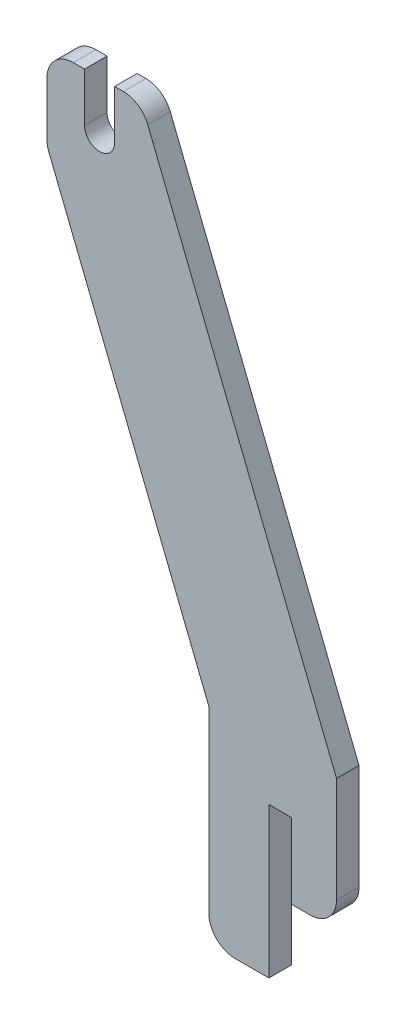
ISO-10303-21;
HEADER;
FILE_DESCRIPTION(('STEP AP214'),'2;1');
FILE_NAME('part.step','',(''),(''),'','','');
FILE_SCHEMA(('AUTOMOTIVE_DESIGN { 1 0 10303 214 1 1 1 1 }'));
ENDSEC;
DATA;
#1=APPLICATION_CONTEXT('core data for automotive mechanical design processes');
#2=APPLICATION_PROTOCOL_DEFINITION('international standard','automotive_design',2000,#1);
#3=PRODUCT_CONTEXT('',#1,'mechanical');
#4=PRODUCT('Part','Part','',(#3));
#5=PRODUCT_RELATED_PRODUCT_CATEGORY('part','',(#4));
#6=PRODUCT_DEFINITION_FORMATION('','',#4);
#7=PRODUCT_DEFINITION_CONTEXT('part definition',#1,'design');
#8=PRODUCT_DEFINITION('design','',#6,#7);
#9=PRODUCT_DEFINITION_SHAPE('','',#8);
#10=(LENGTH_UNIT() NAMED_UNIT(*) SI_UNIT(.MILLI.,.METRE.));
#11=(NAMED_UNIT(*) PLANE_ANGLE_UNIT() SI_UNIT($,.RADIAN.));
#12=(NAMED_UNIT(*) SI_UNIT($,.STERADIAN.) SOLID_ANGLE_UNIT());
#13=UNCERTAINTY_MEASURE_WITH_UNIT(LENGTH_MEASURE(1.E-05),#10,'distance_accuracy_value','');
#14=(GEOMETRIC_REPRESENTATION_CONTEXT(3) GLOBAL_UNCERTAINTY_ASSIGNED_CONTEXT((#13)) GLOBAL_UNIT_ASSIGNED_CONTEXT((#10,
#11,#12)) REPRESENTATION_CONTEXT('',''));
#15=CARTESIAN_POINT('',(0.,0.,0.));
#16=DIRECTION('',(0.,0.,1.));
#17=DIRECTION('',(1.,0.,0.));
#18=AXIS2_PLACEMENT_3D('',#15,#16,#17);
#19=CARTESIAN_POINT('',(153.518730442285,253.090872108874,6.));
#20=DIRECTION('',(0.,0.,-1.));
#21=DIRECTION('',(-1.,0.,0.));
#22=AXIS2_PLACEMENT_3D('',#19,#20,#21);
#23=CYLINDRICAL_SURFACE('',#22,4.);
#24=CARTESIAN_POINT('',(153.518730442285,253.090872108874,0.));
#25=DIRECTION('',(0.,0.,-1.));
#26=DIRECTION('',(1.,0.,0.));
#27=AXIS2_PLACEMENT_3D('',#24,#25,#26);
#28=CIRCLE('',#27,4.);
#29=CARTESIAN_POINT('',(157.518730442285,253.090872108874,0.));
#30=VERTEX_POINT('',#29);
#31=CARTESIAN_POINT('',(149.518730442285,253.090872108874,0.));
#32=VERTEX_POINT('',#31);
#33=EDGE_CURVE('E206',#30,#32,#28,.T.);
#34=ORIENTED_EDGE('',*,*,#33,.T.);
#35=DIRECTION('',(0.,0.,-1.));
#36=VECTOR('',#35,1.);
#37=CARTESIAN_POINT('',(149.518730442285,253.090872108874,6.));
#38=LINE('',#37,#36);
#39=CARTESIAN_POINT('',(149.518730442285,253.090872108874,6.));
#40=VERTEX_POINT('',#39);
#41=EDGE_CURVE('E11',#40,#32,#38,.T.);
#42=ORIENTED_EDGE('',*,*,#41,.F.);
#43=CARTESIAN_POINT('',(153.518730442285,253.090872108874,6.));
#44=DIRECTION('',(0.,0.,-1.));
#45=DIRECTION('',(1.,0.,0.));
#46=AXIS2_PLACEMENT_3D('',#43,#44,#45);
#47=CIRCLE('',#46,4.);
#48=CARTESIAN_POINT('',(157.518730442285,253.090872108874,6.));
#49=VERTEX_POINT('',#48);
#50=EDGE_CURVE('E244',#49,#40,#47,.T.);
#51=ORIENTED_EDGE('',*,*,#50,.F.);
#52=DIRECTION('',(0.,0.,-1.));
#53=VECTOR('',#52,1.);
#54=CARTESIAN_POINT('',(157.518730442285,253.090872108874,6.));
#55=LINE('',#54,#53);
#56=EDGE_CURVE('E202',#49,#30,#55,.T.);
#57=ORIENTED_EDGE('',*,*,#56,.T.);
#58=EDGE_LOOP('',(#34,#42,#51,#57));
#59=FACE_BOUND('',#58,.T.);
#60=ADVANCED_FACE('F38',(#59),#23,.F.);
#61=CARTESIAN_POINT('',(149.518730442285,266.090872108874,6.));
#62=DIRECTION('',(-1.,0.,0.));
#63=DIRECTION('',(0.,-1.,0.));
#64=AXIS2_PLACEMENT_3D('',#61,#62,#63);
#65=PLANE('',#64);
#66=DIRECTION('',(0.,1.,0.));
#67=VECTOR('',#66,1.);
#68=CARTESIAN_POINT('',(149.518730442285,266.090872108874,0.));
#69=LINE('',#68,#67);
#70=CARTESIAN_POINT('',(149.518730442285,266.090872108874,0.));
#71=VERTEX_POINT('',#70);
#72=EDGE_CURVE('E209',#32,#71,#69,.T.);
#73=ORIENTED_EDGE('',*,*,#72,.T.);
#74=DIRECTION('',(0.,0.,-1.));
#75=VECTOR('',#74,1.);
#76=CARTESIAN_POINT('',(149.518730442285,266.090872108874,6.));
#77=LINE('',#76,#75);
#78=CARTESIAN_POINT('',(149.518730442285,266.090872108874,6.));
#79=VERTEX_POINT('',#78);
#80=EDGE_CURVE('E46',#79,#71,#77,.T.);
#81=ORIENTED_EDGE('',*,*,#80,.F.);
#82=DIRECTION('',(0.,1.,0.));
#83=VECTOR('',#82,1.);
#84=CARTESIAN_POINT('',(149.518730442285,266.090872108874,6.));
#85=LINE('',#84,#83);
#86=EDGE_CURVE('E133',#40,#79,#85,.T.);
#87=ORIENTED_EDGE('',*,*,#86,.F.);
#88=ORIENTED_EDGE('',*,*,#41,.T.);
#89=EDGE_LOOP('',(#73,#81,#87,#88));
#90=FACE_BOUND('',#89,.T.);
#91=ADVANCED_FACE('F362',(#90),#65,.F.);
#92=CARTESIAN_POINT('',(149.518730442285,266.090872108874,6.));
#93=DIRECTION('',(0.,-1.,0.));
#94=DIRECTION('',(0.,0.,-1.));
#95=AXIS2_PLACEMENT_3D('',#92,#93,#94);
#96=PLANE('',#95);
#97=DIRECTION('',(-1.,0.,0.));
#98=VECTOR('',#97,1.);
#99=CARTESIAN_POINT('',(149.518730442285,266.090872108874,0.));
#100=LINE('',#99,#98);
#101=CARTESIAN_POINT('',(146.518730442285,266.090872108874,0.));
#102=VERTEX_POINT('',#101);
#103=EDGE_CURVE('E211',#71,#102,#100,.T.);
#104=ORIENTED_EDGE('',*,*,#103,.T.);
#105=DIRECTION('',(0.,0.,-1.));
#106=VECTOR('',#105,1.);
#107=CARTESIAN_POINT('',(146.518730442285,266.090872108874,6.));
#108=LINE('',#107,#106);
#109=CARTESIAN_POINT('',(146.518730442285,266.090872108874,6.));
#110=VERTEX_POINT('',#109);
#111=EDGE_CURVE('E287',#110,#102,#108,.T.);
#112=ORIENTED_EDGE('',*,*,#111,.F.);
#113=DIRECTION('',(-1.,0.,0.));
#114=VECTOR('',#113,1.);
#115=CARTESIAN_POINT('',(149.518730442285,266.090872108874,6.));
#116=LINE('',#115,#114);
#117=EDGE_CURVE('E295',#79,#110,#116,.T.);
#118=ORIENTED_EDGE('',*,*,#117,.F.);
#119=ORIENTED_EDGE('',*,*,#80,.T.);
#120=EDGE_LOOP('',(#104,#112,#118,#119));
#121=FACE_BOUND('',#120,.T.);
#122=ADVANCED_FACE('F293',(#121),#96,.F.);
#123=CARTESIAN_POINT('',(146.518730442285,259.090872108874,6.));
#124=DIRECTION('',(0.,0.,-1.));
#125=DIRECTION('',(-1.,0.,0.));
#126=AXIS2_PLACEMENT_3D('',#123,#124,#125);
#127=CYLINDRICAL_SURFACE('',#126,6.99999999999998);
#128=CARTESIAN_POINT('',(146.518730442285,259.090872108874,0.));
#129=DIRECTION('',(0.,0.,1.));
#130=DIRECTION('',(1.,0.,0.));
#131=AXIS2_PLACEMENT_3D('',#128,#129,#130);
#132=CIRCLE('',#131,6.99999999999998);
#133=CARTESIAN_POINT('',(139.518730442285,259.090872108874,0.));
#134=VERTEX_POINT('',#133);
#135=EDGE_CURVE('E213',#102,#134,#132,.T.);
#136=ORIENTED_EDGE('',*,*,#135,.T.);
#137=DIRECTION('',(0.,0.,-1.));
#138=VECTOR('',#137,1.);
#139=CARTESIAN_POINT('',(139.518730442285,259.090872108874,6.));
#140=LINE('',#139,#138);
#141=CARTESIAN_POINT('',(139.518730442285,259.090872108874,6.));
#142=VERTEX_POINT('',#141);
#143=EDGE_CURVE('E284',#142,#134,#140,.T.);
#144=ORIENTED_EDGE('',*,*,#143,.F.);
#145=CARTESIAN_POINT('',(146.518730442285,259.090872108874,6.));
#146=DIRECTION('',(0.,0.,1.));
#147=DIRECTION('',(1.,0.,0.));
#148=AXIS2_PLACEMENT_3D('',#145,#146,#147);
#149=CIRCLE('',#148,6.99999999999998);
#150=EDGE_CURVE('E313',#110,#142,#149,.T.);
#151=ORIENTED_EDGE('',*,*,#150,.F.);
#152=ORIENTED_EDGE('',*,*,#111,.T.);
#153=EDGE_LOOP('',(#136,#144,#151,#152));
#154=FACE_BOUND('',#153,.T.);
#155=ADVANCED_FACE('F304',(#154),#127,.T.);
#156=CARTESIAN_POINT('',(139.518730442285,259.090872108874,6.));
#157=DIRECTION('',(1.,0.,0.));
#158=DIRECTION('',(0.,0.,-1.));
#159=AXIS2_PLACEMENT_3D('',#156,#157,#158);
#160=PLANE('',#159);
#161=DIRECTION('',(0.,-1.,0.));
#162=VECTOR('',#161,1.);
#163=CARTESIAN_POINT('',(139.518730442285,259.090872108874,0.));
#164=LINE('',#163,#162);
#165=CARTESIAN_POINT('',(139.518730442285,244.812476298915,0.));
#166=VERTEX_POINT('',#165);
#167=EDGE_CURVE('E215',#134,#166,#164,.T.);
#168=ORIENTED_EDGE('',*,*,#167,.T.);
#169=DIRECTION('',(0.,0.,-1.));
#170=VECTOR('',#169,1.);
#171=CARTESIAN_POINT('',(139.518730442285,244.812476298915,6.));
#172=LINE('',#171,#170);
#173=CARTESIAN_POINT('',(139.518730442285,244.812476298915,6.));
#174=VERTEX_POINT('',#173);
#175=EDGE_CURVE('E281',#174,#166,#172,.T.);
#176=ORIENTED_EDGE('',*,*,#175,.F.);
#177=DIRECTION('',(0.,-1.,0.));
#178=VECTOR('',#177,1.);
#179=CARTESIAN_POINT('',(139.518730442285,259.090872108874,6.));
#180=LINE('',#179,#178);
#181=EDGE_CURVE('E310',#142,#174,#180,.T.);
#182=ORIENTED_EDGE('',*,*,#181,.F.);
#183=ORIENTED_EDGE('',*,*,#143,.T.);
#184=EDGE_LOOP('',(#168,#176,#182,#183));
#185=FACE_BOUND('',#184,.T.);
#186=ADVANCED_FACE('F308',(#185),#160,.F.);
#187=CARTESIAN_POINT('',(146.518730442285,244.812476298915,6.));
#188=DIRECTION('',(0.,0.,-1.));
#189=DIRECTION('',(-1.,0.,0.));
#190=AXIS2_PLACEMENT_3D('',#187,#188,#189);
#191=CYLINDRICAL_SURFACE('',#190,7.00000000000001);
#192=CARTESIAN_POINT('',(146.518730442285,244.812476298915,0.));
#193=DIRECTION('',(0.,0.,1.));
#194=DIRECTION('',(1.,0.,0.));
#195=AXIS2_PLACEMENT_3D('',#192,#193,#194);
#196=CIRCLE('',#195,7.00000000000001);
#197=CARTESIAN_POINT('',(140.019393606088,242.212741564437,0.));
#198=VERTEX_POINT('',#197);
#199=EDGE_CURVE('E217',#166,#198,#196,.T.);
#200=ORIENTED_EDGE('',*,*,#199,.T.);
#201=DIRECTION('',(0.,0.,-1.));
#202=VECTOR('',#201,1.);
#203=CARTESIAN_POINT('',(140.019393606088,242.212741564437,6.));
#204=LINE('',#203,#202);
#205=CARTESIAN_POINT('',(140.019393606088,242.212741564437,6.));
#206=VERTEX_POINT('',#205);
#207=EDGE_CURVE('E278',#206,#198,#204,.T.);
#208=ORIENTED_EDGE('',*,*,#207,.F.);
#209=CARTESIAN_POINT('',(146.518730442285,244.812476298915,6.));
#210=DIRECTION('',(0.,0.,1.));
#211=DIRECTION('',(1.,0.,0.));
#212=AXIS2_PLACEMENT_3D('',#209,#210,#211);
#213=CIRCLE('',#212,7.00000000000001);
#214=EDGE_CURVE('E312',#174,#206,#213,.T.);
#215=ORIENTED_EDGE('',*,*,#214,.F.);
#216=ORIENTED_EDGE('',*,*,#175,.T.);
#217=EDGE_LOOP('',(#200,#208,#215,#216));
#218=FACE_BOUND('',#217,.T.);
#219=ADVANCED_FACE('F375',(#218),#191,.T.);
#220=CARTESIAN_POINT('',(140.019393606088,242.212741564437,6.));
#221=DIRECTION('',(0.928476690885259,0.371390676354103,0.));
#222=DIRECTION('',(-0.371390676354103,0.92847669088526,0.));
#223=AXIS2_PLACEMENT_3D('',#220,#221,#222);
#224=PLANE('',#223);
#225=DIRECTION('',(0.371390676354103,-0.92847669088526,0.));
#226=VECTOR('',#225,1.);
#227=CARTESIAN_POINT('',(140.019393606088,242.212741564437,0.));
#228=LINE('',#227,#226);
#229=CARTESIAN_POINT('',(182.587601096187,135.792222839189,0.));
#230=VERTEX_POINT('',#229);
#231=EDGE_CURVE('E219',#198,#230,#228,.T.);
#232=ORIENTED_EDGE('',*,*,#231,.T.);
#233=DIRECTION('',(0.,0.,-1.));
#234=VECTOR('',#233,1.);
#235=CARTESIAN_POINT('',(182.587601096187,135.792222839189,6.));
#236=LINE('',#235,#234);
#237=CARTESIAN_POINT('',(182.587601096187,135.792222839189,6.));
#238=VERTEX_POINT('',#237);
#239=EDGE_CURVE('E275',#238,#230,#236,.T.);
#240=ORIENTED_EDGE('',*,*,#239,.F.);
#241=DIRECTION('',(0.371390676354103,-0.92847669088526,0.));
#242=VECTOR('',#241,1.);
#243=CARTESIAN_POINT('',(140.019393606088,242.212741564437,6.));
#244=LINE('',#243,#242);
#245=EDGE_CURVE('E315',#206,#238,#244,.T.);
#246=ORIENTED_EDGE('',*,*,#245,.F.);
#247=ORIENTED_EDGE('',*,*,#207,.T.);
#248=EDGE_LOOP('',(#232,#240,#246,#247));
#249=FACE_BOUND('',#248,.T.);
#250=ADVANCED_FACE('F378',(#249),#224,.F.);
#251=CARTESIAN_POINT('',(182.587601096187,88.0908721088744,6.));
#252=DIRECTION('',(1.,0.,0.));
#253=DIRECTION('',(0.,0.,-1.));
#254=AXIS2_PLACEMENT_3D('',#251,#252,#253);
#255=PLANE('',#254);
#256=DIRECTION('',(0.,-1.,0.));
#257=VECTOR('',#256,1.);
#258=CARTESIAN_POINT('',(182.587601096187,88.0908721088744,0.));
#259=LINE('',#258,#257);
#260=CARTESIAN_POINT('',(182.587601096187,88.0908721088744,0.));
#261=VERTEX_POINT('',#260);
#262=EDGE_CURVE('E221',#230,#261,#259,.T.);
#263=ORIENTED_EDGE('',*,*,#262,.T.);
#264=DIRECTION('',(0.,0.,-1.));
#265=VECTOR('',#264,1.);
#266=CARTESIAN_POINT('',(182.587601096187,88.0908721088744,6.));
#267=LINE('',#266,#265);
#268=CARTESIAN_POINT('',(182.587601096187,88.0908721088744,6.));
#269=VERTEX_POINT('',#268);
#270=EDGE_CURVE('E272',#269,#261,#267,.T.);
#271=ORIENTED_EDGE('',*,*,#270,.F.);
#272=DIRECTION('',(0.,-1.,0.));
#273=VECTOR('',#272,1.);
#274=CARTESIAN_POINT('',(182.587601096187,88.0908721088744,6.));
#275=LINE('',#274,#273);
#276=EDGE_CURVE('E321',#238,#269,#275,.T.);
#277=ORIENTED_EDGE('',*,*,#276,.F.);
#278=ORIENTED_EDGE('',*,*,#239,.T.);
#279=EDGE_LOOP('',(#263,#271,#277,#278));
#280=FACE_BOUND('',#279,.T.);
#281=ADVANCED_FACE('F382',(#280),#255,.F.);
#282=CARTESIAN_POINT('',(189.587601096187,88.0908721088744,6.));
#283=DIRECTION('',(0.,0.,-1.));
#284=DIRECTION('',(-1.,0.,0.));
#285=AXIS2_PLACEMENT_3D('',#282,#283,#284);
#286=CYLINDRICAL_SURFACE('',#285,7.);
#287=CARTESIAN_POINT('',(189.587601096187,88.0908721088744,0.));
#288=DIRECTION('',(0.,0.,1.));
#289=DIRECTION('',(1.,0.,0.));
#290=AXIS2_PLACEMENT_3D('',#287,#288,#289);
#291=CIRCLE('',#290,7.);
#292=CARTESIAN_POINT('',(189.587601096187,81.0908721088744,0.));
#293=VERTEX_POINT('',#292);
#294=EDGE_CURVE('E223',#261,#293,#291,.T.);
#295=ORIENTED_EDGE('',*,*,#294,.T.);
#296=DIRECTION('',(0.,0.,-1.));
#297=VECTOR('',#296,1.);
#298=CARTESIAN_POINT('',(189.587601096187,81.0908721088744,6.));
#299=LINE('',#298,#297);
#300=CARTESIAN_POINT('',(189.587601096187,81.0908721088744,6.));
#301=VERTEX_POINT('',#300);
#302=EDGE_CURVE('E269',#301,#293,#299,.T.);
#303=ORIENTED_EDGE('',*,*,#302,.F.);
#304=CARTESIAN_POINT('',(189.587601096187,88.0908721088744,6.));
#305=DIRECTION('',(0.,0.,1.));
#306=DIRECTION('',(1.,0.,0.));
#307=AXIS2_PLACEMENT_3D('',#304,#305,#306);
#308=CIRCLE('',#307,7.);
#309=EDGE_CURVE('E323',#269,#301,#308,.T.);
#310=ORIENTED_EDGE('',*,*,#309,.F.);
#311=ORIENTED_EDGE('',*,*,#270,.T.);
#312=EDGE_LOOP('',(#295,#303,#310,#311));
#313=FACE_BOUND('',#312,.T.);
#314=ADVANCED_FACE('F386',(#313),#286,.T.);
#315=CARTESIAN_POINT('',(189.587601096187,81.0908721088744,6.));
#316=DIRECTION('',(0.,1.,0.));
#317=DIRECTION('',(0.,0.,1.));
#318=AXIS2_PLACEMENT_3D('',#315,#316,#317);
#319=PLANE('',#318);
#320=DIRECTION('',(1.,0.,0.));
#321=VECTOR('',#320,1.);
#322=CARTESIAN_POINT('',(189.587601096187,81.0908721088744,0.));
#323=LINE('',#322,#321);
#324=CARTESIAN_POINT('',(198.587601096187,81.0908721088744,0.));
#325=VERTEX_POINT('',#324);
#326=EDGE_CURVE('E225',#293,#325,#323,.T.);
#327=ORIENTED_EDGE('',*,*,#326,.T.);
#328=DIRECTION('',(0.,0.,-1.));
#329=VECTOR('',#328,1.);
#330=CARTESIAN_POINT('',(198.587601096187,81.0908721088744,6.));
#331=LINE('',#330,#329);
#332=CARTESIAN_POINT('',(198.587601096187,81.0908721088744,6.));
#333=VERTEX_POINT('',#332);
#334=EDGE_CURVE('E266',#333,#325,#331,.T.);
#335=ORIENTED_EDGE('',*,*,#334,.F.);
#336=DIRECTION('',(1.,0.,0.));
#337=VECTOR('',#336,1.);
#338=CARTESIAN_POINT('',(189.587601096187,81.0908721088744,6.));
#339=LINE('',#338,#337);
#340=EDGE_CURVE('E325',#301,#333,#339,.T.);
#341=ORIENTED_EDGE('',*,*,#340,.F.);
#342=ORIENTED_EDGE('',*,*,#302,.T.);
#343=EDGE_LOOP('',(#327,#335,#341,#342));
#344=FACE_BOUND('',#343,.T.);
#345=ADVANCED_FACE('F390',(#344),#319,.F.);
#346=CARTESIAN_POINT('',(198.587601096187,81.0908721088744,6.));
#347=DIRECTION('',(-1.,0.,0.));
#348=DIRECTION('',(0.,0.,1.));
#349=AXIS2_PLACEMENT_3D('',#346,#347,#348);
#350=PLANE('',#349);
#351=DIRECTION('',(0.,1.,0.));
#352=VECTOR('',#351,1.);
#353=CARTESIAN_POINT('',(198.587601096187,81.0908721088744,0.));
#354=LINE('',#353,#352);
#355=CARTESIAN_POINT('',(198.587601096187,121.090872108874,0.));
#356=VERTEX_POINT('',#355);
#357=EDGE_CURVE('E227',#325,#356,#354,.T.);
#358=ORIENTED_EDGE('',*,*,#357,.T.);
#359=DIRECTION('',(0.,0.,-1.));
#360=VECTOR('',#359,1.);
#361=CARTESIAN_POINT('',(198.587601096187,121.090872108874,6.));
#362=LINE('',#361,#360);
#363=CARTESIAN_POINT('',(198.587601096187,121.090872108874,6.));
#364=VERTEX_POINT('',#363);
#365=EDGE_CURVE('E263',#364,#356,#362,.T.);
#366=ORIENTED_EDGE('',*,*,#365,.F.);
#367=DIRECTION('',(0.,1.,0.));
#368=VECTOR('',#367,1.);
#369=CARTESIAN_POINT('',(198.587601096187,81.0908721088744,6.));
#370=LINE('',#369,#368);
#371=EDGE_CURVE('E327',#333,#364,#370,.T.);
#372=ORIENTED_EDGE('',*,*,#371,.F.);
#373=ORIENTED_EDGE('',*,*,#334,.T.);
#374=EDGE_LOOP('',(#358,#366,#372,#373));
#375=FACE_BOUND('',#374,.T.);
#376=ADVANCED_FACE('F394',(#375),#350,.F.);
#377=CARTESIAN_POINT('',(198.587601096187,121.090872108874,6.));
#378=DIRECTION('',(0.,1.,0.));
#379=DIRECTION('',(0.,0.,1.));
#380=AXIS2_PLACEMENT_3D('',#377,#378,#379);
#381=PLANE('',#380);
#382=DIRECTION('',(1.,0.,0.));
#383=VECTOR('',#382,1.);
#384=CARTESIAN_POINT('',(198.587601096187,121.090872108874,0.));
#385=LINE('',#384,#383);
#386=CARTESIAN_POINT('',(204.587601096187,121.090872108874,0.));
#387=VERTEX_POINT('',#386);
#388=EDGE_CURVE('E229',#356,#387,#385,.T.);
#389=ORIENTED_EDGE('',*,*,#388,.T.);
#390=DIRECTION('',(0.,0.,-1.));
#391=VECTOR('',#390,1.);
#392=CARTESIAN_POINT('',(204.587601096187,121.090872108874,6.));
#393=LINE('',#392,#391);
#394=CARTESIAN_POINT('',(204.587601096187,121.090872108874,6.));
#395=VERTEX_POINT('',#394);
#396=EDGE_CURVE('E260',#395,#387,#393,.T.);
#397=ORIENTED_EDGE('',*,*,#396,.F.);
#398=DIRECTION('',(1.,0.,0.));
#399=VECTOR('',#398,1.);
#400=CARTESIAN_POINT('',(198.587601096187,121.090872108874,6.));
#401=LINE('',#400,#399);
#402=EDGE_CURVE('E329',#364,#395,#401,.T.);
#403=ORIENTED_EDGE('',*,*,#402,.F.);
#404=ORIENTED_EDGE('',*,*,#365,.T.);
#405=EDGE_LOOP('',(#389,#397,#403,#404));
#406=FACE_BOUND('',#405,.T.);
#407=ADVANCED_FACE('F398',(#406),#381,.F.);
#408=CARTESIAN_POINT('',(204.587601096187,121.090872108874,6.));
#409=DIRECTION('',(1.,0.,0.));
#410=DIRECTION('',(0.,0.,-1.));
#411=AXIS2_PLACEMENT_3D('',#408,#409,#410);
#412=PLANE('',#411);
#413=DIRECTION('',(0.,-1.,0.));
#414=VECTOR('',#413,1.);
#415=CARTESIAN_POINT('',(204.587601096187,121.090872108874,0.));
#416=LINE('',#415,#414);
#417=CARTESIAN_POINT('',(204.587601096187,101.090872108874,0.));
#418=VERTEX_POINT('',#417);
#419=EDGE_CURVE('E231',#387,#418,#416,.T.);
#420=ORIENTED_EDGE('',*,*,#419,.T.);
#421=DIRECTION('',(0.,0.,-1.));
#422=VECTOR('',#421,1.);
#423=CARTESIAN_POINT('',(204.587601096187,101.090872108874,6.));
#424=LINE('',#423,#422);
#425=CARTESIAN_POINT('',(204.587601096187,101.090872108874,6.));
#426=VERTEX_POINT('',#425);
#427=EDGE_CURVE('E257',#426,#418,#424,.T.);
#428=ORIENTED_EDGE('',*,*,#427,.F.);
#429=DIRECTION('',(0.,-1.,0.));
#430=VECTOR('',#429,1.);
#431=CARTESIAN_POINT('',(204.587601096187,121.090872108874,6.));
#432=LINE('',#431,#430);
#433=EDGE_CURVE('E331',#395,#426,#432,.T.);
#434=ORIENTED_EDGE('',*,*,#433,.F.);
#435=ORIENTED_EDGE('',*,*,#396,.T.);
#436=EDGE_LOOP('',(#420,#428,#434,#435));
#437=FACE_BOUND('',#436,.T.);
#438=ADVANCED_FACE('F402',(#437),#412,.F.);
#439=CARTESIAN_POINT('',(204.587601096187,101.090872108874,6.));
#440=DIRECTION('',(0.,1.,0.));
#441=DIRECTION('',(0.,0.,1.));
#442=AXIS2_PLACEMENT_3D('',#439,#440,#441);
#443=PLANE('',#442);
#444=DIRECTION('',(1.,0.,0.));
#445=VECTOR('',#444,1.);
#446=CARTESIAN_POINT('',(204.587601096187,101.090872108874,0.));
#447=LINE('',#446,#445);
#448=CARTESIAN_POINT('',(209.587601096187,101.090872108874,0.));
#449=VERTEX_POINT('',#448);
#450=EDGE_CURVE('E233',#418,#449,#447,.T.);
#451=ORIENTED_EDGE('',*,*,#450,.T.);
#452=DIRECTION('',(0.,0.,-1.));
#453=VECTOR('',#452,1.);
#454=CARTESIAN_POINT('',(209.587601096187,101.090872108874,6.));
#455=LINE('',#454,#453);
#456=CARTESIAN_POINT('',(209.587601096187,101.090872108874,6.));
#457=VERTEX_POINT('',#456);
#458=EDGE_CURVE('E254',#457,#449,#455,.T.);
#459=ORIENTED_EDGE('',*,*,#458,.F.);
#460=DIRECTION('',(1.,0.,0.));
#461=VECTOR('',#460,1.);
#462=CARTESIAN_POINT('',(204.587601096187,101.090872108874,6.));
#463=LINE('',#462,#461);
#464=EDGE_CURVE('E333',#426,#457,#463,.T.);
#465=ORIENTED_EDGE('',*,*,#464,.F.);
#466=ORIENTED_EDGE('',*,*,#427,.T.);
#467=EDGE_LOOP('',(#451,#459,#465,#466));
#468=FACE_BOUND('',#467,.T.);
#469=ADVANCED_FACE('F406',(#468),#443,.F.);
#470=CARTESIAN_POINT('',(209.587601096187,108.090872108874,6.));
#471=DIRECTION('',(0.,0.,-1.));
#472=DIRECTION('',(-1.,0.,0.));
#473=AXIS2_PLACEMENT_3D('',#470,#471,#472);
#474=CYLINDRICAL_SURFACE('',#473,7.00000000000001);
#475=CARTESIAN_POINT('',(209.587601096187,108.090872108874,0.));
#476=DIRECTION('',(0.,0.,1.));
#477=DIRECTION('',(1.,0.,0.));
#478=AXIS2_PLACEMENT_3D('',#475,#476,#477);
#479=CIRCLE('',#478,7.00000000000001);
#480=CARTESIAN_POINT('',(216.587601096187,108.090872108874,0.));
#481=VERTEX_POINT('',#480);
#482=EDGE_CURVE('E235',#449,#481,#479,.T.);
#483=ORIENTED_EDGE('',*,*,#482,.T.);
#484=DIRECTION('',(0.,0.,-1.));
#485=VECTOR('',#484,1.);
#486=CARTESIAN_POINT('',(216.587601096187,108.090872108874,6.));
#487=LINE('',#486,#485);
#488=CARTESIAN_POINT('',(216.587601096187,108.090872108874,6.));
#489=VERTEX_POINT('',#488);
#490=EDGE_CURVE('E251',#489,#481,#487,.T.);
#491=ORIENTED_EDGE('',*,*,#490,.F.);
#492=CARTESIAN_POINT('',(209.587601096187,108.090872108874,6.));
#493=DIRECTION('',(0.,0.,1.));
#494=DIRECTION('',(1.,0.,0.));
#495=AXIS2_PLACEMENT_3D('',#492,#493,#494);
#496=CIRCLE('',#495,7.00000000000001);
#497=EDGE_CURVE('E335',#457,#489,#496,.T.);
#498=ORIENTED_EDGE('',*,*,#497,.F.);
#499=ORIENTED_EDGE('',*,*,#458,.T.);
#500=EDGE_LOOP('',(#483,#491,#498,#499));
#501=FACE_BOUND('',#500,.T.);
#502=ADVANCED_FACE('F410',(#501),#474,.T.);
#503=CARTESIAN_POINT('',(216.587601096187,108.090872108874,6.));
#504=DIRECTION('',(-1.,0.,0.));
#505=DIRECTION('',(0.,0.,1.));
#506=AXIS2_PLACEMENT_3D('',#503,#504,#505);
#507=PLANE('',#506);
#508=DIRECTION('',(0.,1.,0.));
#509=VECTOR('',#508,1.);
#510=CARTESIAN_POINT('',(216.587601096187,108.090872108874,0.));
#511=LINE('',#510,#509);
#512=CARTESIAN_POINT('',(216.587601096187,136.090872108874,0.));
#513=VERTEX_POINT('',#512);
#514=EDGE_CURVE('E237',#481,#513,#511,.T.);
#515=ORIENTED_EDGE('',*,*,#514,.T.);
#516=DIRECTION('',(0.,0.,-1.));
#517=VECTOR('',#516,1.);
#518=CARTESIAN_POINT('',(216.587601096187,136.090872108874,6.));
#519=LINE('',#518,#517);
#520=CARTESIAN_POINT('',(216.587601096187,136.090872108874,6.));
#521=VERTEX_POINT('',#520);
#522=EDGE_CURVE('E248',#521,#513,#519,.T.);
#523=ORIENTED_EDGE('',*,*,#522,.F.);
#524=DIRECTION('',(0.,1.,0.));
#525=VECTOR('',#524,1.);
#526=CARTESIAN_POINT('',(216.587601096187,108.090872108874,6.));
#527=LINE('',#526,#525);
#528=EDGE_CURVE('E337',#489,#521,#527,.T.);
#529=ORIENTED_EDGE('',*,*,#528,.F.);
#530=ORIENTED_EDGE('',*,*,#490,.T.);
#531=EDGE_LOOP('',(#515,#523,#529,#530));
#532=FACE_BOUND('',#531,.T.);
#533=ADVANCED_FACE('F343',(#532),#507,.F.);
#534=CARTESIAN_POINT('',(216.587601096187,136.090872108874,6.));
#535=DIRECTION('',(-0.928476690885259,-0.371390676354104,0.));
#536=DIRECTION('',(0.371390676354104,-0.928476690885259,0.));
#537=AXIS2_PLACEMENT_3D('',#534,#535,#536);
#538=PLANE('',#537);
#539=DIRECTION('',(-0.371390676354104,0.928476690885259,0.));
#540=VECTOR('',#539,1.);
#541=CARTESIAN_POINT('',(216.587601096187,136.090872108874,0.));
#542=LINE('',#541,#540);
#543=CARTESIAN_POINT('',(166.347707202395,261.690606843353,0.));
#544=VERTEX_POINT('',#543);
#545=EDGE_CURVE('E239',#513,#544,#542,.T.);
#546=ORIENTED_EDGE('',*,*,#545,.T.);
#547=DIRECTION('',(0.,0.,-1.));
#548=VECTOR('',#547,1.);
#549=CARTESIAN_POINT('',(166.347707202395,261.690606843353,6.));
#550=LINE('',#549,#548);
#551=CARTESIAN_POINT('',(166.347707202395,261.690606843353,6.));
#552=VERTEX_POINT('',#551);
#553=EDGE_CURVE('E197',#552,#544,#550,.T.);
#554=ORIENTED_EDGE('',*,*,#553,.F.);
#555=DIRECTION('',(-0.371390676354104,0.928476690885259,0.));
#556=VECTOR('',#555,1.);
#557=CARTESIAN_POINT('',(216.587601096187,136.090872108874,6.));
#558=LINE('',#557,#556);
#559=EDGE_CURVE('E188',#521,#552,#558,.T.);
#560=ORIENTED_EDGE('',*,*,#559,.F.);
#561=ORIENTED_EDGE('',*,*,#522,.T.);
#562=EDGE_LOOP('',(#546,#554,#560,#561));
#563=FACE_BOUND('',#562,.T.);
#564=ADVANCED_FACE('F347',(#563),#538,.F.);
#565=CARTESIAN_POINT('',(159.848370366198,259.090872108874,6.));
#566=DIRECTION('',(0.,0.,-1.));
#567=DIRECTION('',(-1.,0.,0.));
#568=AXIS2_PLACEMENT_3D('',#565,#566,#567);
#569=CYLINDRICAL_SURFACE('',#568,7.);
#570=CARTESIAN_POINT('',(159.848370366198,259.090872108874,0.));
#571=DIRECTION('',(0.,0.,1.));
#572=DIRECTION('',(1.,0.,0.));
#573=AXIS2_PLACEMENT_3D('',#570,#571,#572);
#574=CIRCLE('',#573,7.);
#575=CARTESIAN_POINT('',(159.848370366198,266.090872108874,0.));
#576=VERTEX_POINT('',#575);
#577=EDGE_CURVE('E196',#544,#576,#574,.T.);
#578=ORIENTED_EDGE('',*,*,#577,.T.);
#579=DIRECTION('',(0.,0.,-1.));
#580=VECTOR('',#579,1.);
#581=CARTESIAN_POINT('',(159.848370366198,266.090872108874,6.));
#582=LINE('',#581,#580);
#583=CARTESIAN_POINT('',(159.848370366198,266.090872108874,6.));
#584=VERTEX_POINT('',#583);
#585=EDGE_CURVE('E193',#584,#576,#582,.T.);
#586=ORIENTED_EDGE('',*,*,#585,.F.);
#587=CARTESIAN_POINT('',(159.848370366198,259.090872108874,6.));
#588=DIRECTION('',(0.,0.,1.));
#589=DIRECTION('',(1.,0.,0.));
#590=AXIS2_PLACEMENT_3D('',#587,#588,#589);
#591=CIRCLE('',#590,7.);
#592=EDGE_CURVE('E182',#552,#584,#591,.T.);
#593=ORIENTED_EDGE('',*,*,#592,.F.);
#594=ORIENTED_EDGE('',*,*,#553,.T.);
#595=EDGE_LOOP('',(#578,#586,#593,#594));
#596=FACE_BOUND('',#595,.T.);
#597=ADVANCED_FACE('F194',(#596),#569,.T.);
#598=CARTESIAN_POINT('',(159.848370366198,266.090872108874,6.));
#599=DIRECTION('',(0.,-1.,0.));
#600=DIRECTION('',(0.,0.,-1.));
#601=AXIS2_PLACEMENT_3D('',#598,#599,#600);
#602=PLANE('',#601);
#603=DIRECTION('',(-1.,0.,0.));
#604=VECTOR('',#603,1.);
#605=CARTESIAN_POINT('',(159.848370366198,266.090872108874,0.));
#606=LINE('',#605,#604);
#607=CARTESIAN_POINT('',(157.518730442285,266.090872108874,0.));
#608=VERTEX_POINT('',#607);
#609=EDGE_CURVE('E119',#576,#608,#606,.T.);
#610=ORIENTED_EDGE('',*,*,#609,.T.);
#611=DIRECTION('',(0.,0.,-1.));
#612=VECTOR('',#611,1.);
#613=CARTESIAN_POINT('',(157.518730442285,266.090872108874,6.));
#614=LINE('',#613,#612);
#615=CARTESIAN_POINT('',(157.518730442285,266.090872108874,6.));
#616=VERTEX_POINT('',#615);
#617=EDGE_CURVE('E198',#616,#608,#614,.T.);
#618=ORIENTED_EDGE('',*,*,#617,.F.);
#619=DIRECTION('',(-1.,0.,0.));
#620=VECTOR('',#619,1.);
#621=CARTESIAN_POINT('',(159.848370366198,266.090872108874,6.));
#622=LINE('',#621,#620);
#623=EDGE_CURVE('E186',#584,#616,#622,.T.);
#624=ORIENTED_EDGE('',*,*,#623,.F.);
#625=ORIENTED_EDGE('',*,*,#585,.T.);
#626=EDGE_LOOP('',(#610,#618,#624,#625));
#627=FACE_BOUND('',#626,.T.);
#628=ADVANCED_FACE('F200',(#627),#602,.F.);
#629=CARTESIAN_POINT('',(157.518730442285,253.090872108874,6.));
#630=DIRECTION('',(1.,0.,0.));
#631=DIRECTION('',(0.,0.,-1.));
#632=AXIS2_PLACEMENT_3D('',#629,#630,#631);
#633=PLANE('',#632);
#634=DIRECTION('',(0.,-1.,0.));
#635=VECTOR('',#634,1.);
#636=CARTESIAN_POINT('',(157.518730442285,253.090872108874,0.));
#637=LINE('',#636,#635);
#638=EDGE_CURVE('E125',#608,#30,#637,.T.);
#639=ORIENTED_EDGE('',*,*,#638,.T.);
#640=ORIENTED_EDGE('',*,*,#56,.F.);
#641=DIRECTION('',(0.,-1.,0.));
#642=VECTOR('',#641,1.);
#643=CARTESIAN_POINT('',(157.518730442285,253.090872108874,6.));
#644=LINE('',#643,#642);
#645=EDGE_CURVE('E54',#616,#49,#644,.T.);
#646=ORIENTED_EDGE('',*,*,#645,.F.);
#647=ORIENTED_EDGE('',*,*,#617,.T.);
#648=EDGE_LOOP('',(#639,#640,#646,#647));
#649=FACE_BOUND('',#648,.T.);
#650=ADVANCED_FACE('F351',(#649),#633,.F.);
#651=CARTESIAN_POINT('',(153.518730442285,253.090872108874,6.));
#652=DIRECTION('',(0.,0.,1.));
#653=DIRECTION('',(1.,0.,0.));
#654=AXIS2_PLACEMENT_3D('',#651,#652,#653);
#655=PLANE('',#654);
#656=ORIENTED_EDGE('',*,*,#50,.T.);
#657=ORIENTED_EDGE('',*,*,#86,.T.);
#658=ORIENTED_EDGE('',*,*,#117,.T.);
#659=ORIENTED_EDGE('',*,*,#150,.T.);
#660=ORIENTED_EDGE('',*,*,#181,.T.);
#661=ORIENTED_EDGE('',*,*,#214,.T.);
#662=ORIENTED_EDGE('',*,*,#245,.T.);
#663=ORIENTED_EDGE('',*,*,#276,.T.);
#664=ORIENTED_EDGE('',*,*,#309,.T.);
#665=ORIENTED_EDGE('',*,*,#340,.T.);
#666=ORIENTED_EDGE('',*,*,#371,.T.);
#667=ORIENTED_EDGE('',*,*,#402,.T.);
#668=ORIENTED_EDGE('',*,*,#433,.T.);
#669=ORIENTED_EDGE('',*,*,#464,.T.);
#670=ORIENTED_EDGE('',*,*,#497,.T.);
#671=ORIENTED_EDGE('',*,*,#528,.T.);
#672=ORIENTED_EDGE('',*,*,#559,.T.);
#673=ORIENTED_EDGE('',*,*,#592,.T.);
#674=ORIENTED_EDGE('',*,*,#623,.T.);
#675=ORIENTED_EDGE('',*,*,#645,.T.);
#676=EDGE_LOOP('',(#656,#657,#658,#659,#660,#661,#662,#663,#664,#665,#666,#667,#668,#669,#670,
#671,#672,#673,#674,#675));
#677=FACE_BOUND('',#676,.T.);
#678=ADVANCED_FACE('F184',(#677),#655,.T.);
#679=CARTESIAN_POINT('',(153.518730442285,253.090872108874,0.));
#680=DIRECTION('',(0.,0.,1.));
#681=DIRECTION('',(1.,0.,0.));
#682=AXIS2_PLACEMENT_3D('',#679,#680,#681);
#683=PLANE('',#682);
#684=ORIENTED_EDGE('',*,*,#33,.F.);
#685=ORIENTED_EDGE('',*,*,#638,.F.);
#686=ORIENTED_EDGE('',*,*,#609,.F.);
#687=ORIENTED_EDGE('',*,*,#577,.F.);
#688=ORIENTED_EDGE('',*,*,#545,.F.);
#689=ORIENTED_EDGE('',*,*,#514,.F.);
#690=ORIENTED_EDGE('',*,*,#482,.F.);
#691=ORIENTED_EDGE('',*,*,#450,.F.);
#692=ORIENTED_EDGE('',*,*,#419,.F.);
#693=ORIENTED_EDGE('',*,*,#388,.F.);
#694=ORIENTED_EDGE('',*,*,#357,.F.);
#695=ORIENTED_EDGE('',*,*,#326,.F.);
#696=ORIENTED_EDGE('',*,*,#294,.F.);
#697=ORIENTED_EDGE('',*,*,#262,.F.);
#698=ORIENTED_EDGE('',*,*,#231,.F.);
#699=ORIENTED_EDGE('',*,*,#199,.F.);
#700=ORIENTED_EDGE('',*,*,#167,.F.);
#701=ORIENTED_EDGE('',*,*,#135,.F.);
#702=ORIENTED_EDGE('',*,*,#103,.F.);
#703=ORIENTED_EDGE('',*,*,#72,.F.);
#704=EDGE_LOOP('',(#684,#685,#686,#687,#688,#689,#690,#691,#692,#693,#694,#695,#696,#697,#698,
#699,#700,#701,#702,#703));
#705=FACE_BOUND('',#704,.T.);
#706=ADVANCED_FACE('F299',(#705),#683,.F.);
#707=CLOSED_SHELL('',(#60,#91,#122,#155,#186,#219,#250,#281,#314,#345,#376,#407,#438,#469,#502,
#533,#564,#597,#628,#650,#678,#706));
#708=MANIFOLD_SOLID_BREP('B2',#707);
#709=ADVANCED_BREP_SHAPE_REPRESENTATION('',(#18,#708),#14);
#710=SHAPE_DEFINITION_REPRESENTATION(#9,#709);
ENDSEC;
END-ISO-10303-21;
